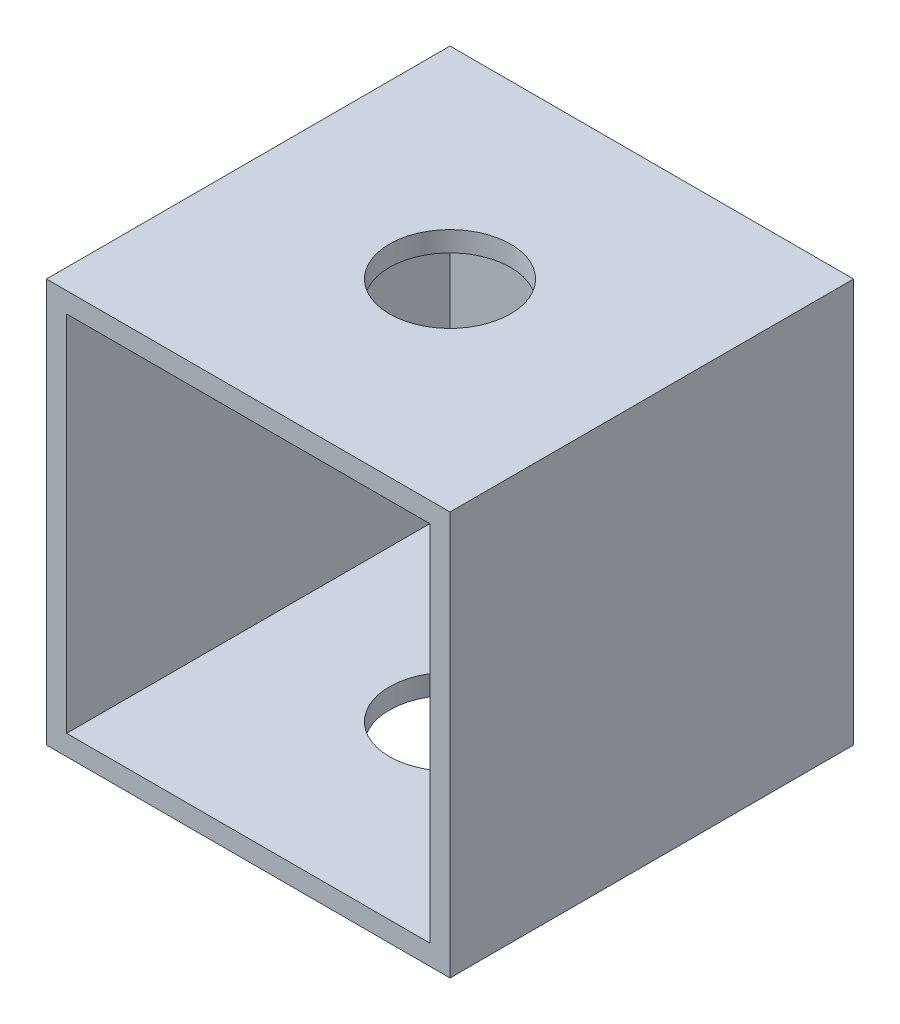
ISO-10303-21;
HEADER;
FILE_DESCRIPTION(('STEP AP214'),'2;1');
FILE_NAME('part.step','',(''),(''),'','','');
FILE_SCHEMA(('AUTOMOTIVE_DESIGN { 1 0 10303 214 1 1 1 1 }'));
ENDSEC;
DATA;
#1=APPLICATION_CONTEXT('core data for automotive mechanical design processes');
#2=APPLICATION_PROTOCOL_DEFINITION('international standard','automotive_design',2000,#1);
#3=PRODUCT_CONTEXT('',#1,'mechanical');
#4=PRODUCT('Part','Part','',(#3));
#5=PRODUCT_RELATED_PRODUCT_CATEGORY('part','',(#4));
#6=PRODUCT_DEFINITION_FORMATION('','',#4);
#7=PRODUCT_DEFINITION_CONTEXT('part definition',#1,'design');
#8=PRODUCT_DEFINITION('design','',#6,#7);
#9=PRODUCT_DEFINITION_SHAPE('','',#8);
#10=(LENGTH_UNIT() NAMED_UNIT(*) SI_UNIT(.MILLI.,.METRE.));
#11=(NAMED_UNIT(*) PLANE_ANGLE_UNIT() SI_UNIT($,.RADIAN.));
#12=(NAMED_UNIT(*) SI_UNIT($,.STERADIAN.) SOLID_ANGLE_UNIT());
#13=UNCERTAINTY_MEASURE_WITH_UNIT(LENGTH_MEASURE(1.E-05),#10,'distance_accuracy_value','');
#14=(GEOMETRIC_REPRESENTATION_CONTEXT(3) GLOBAL_UNCERTAINTY_ASSIGNED_CONTEXT((#13)) GLOBAL_UNIT_ASSIGNED_CONTEXT((#10,
#11,#12)) REPRESENTATION_CONTEXT('',''));
#15=CARTESIAN_POINT('',(0.,0.,0.));
#16=DIRECTION('',(0.,0.,1.));
#17=DIRECTION('',(1.,0.,0.));
#18=AXIS2_PLACEMENT_3D('',#15,#16,#17);
#19=CARTESIAN_POINT('',(0.,0.,40.));
#20=DIRECTION('',(0.,0.,-1.));
#21=DIRECTION('',(-1.,0.,0.));
#22=AXIS2_PLACEMENT_3D('',#19,#20,#21);
#23=PLANE('',#22);
#24=DIRECTION('',(1.,0.,0.));
#25=VECTOR('',#24,1.);
#26=CARTESIAN_POINT('',(20.,-20.,40.));
#27=LINE('',#26,#25);
#28=CARTESIAN_POINT('',(-20.,-20.,40.));
#29=VERTEX_POINT('',#28);
#30=CARTESIAN_POINT('',(20.,-20.,40.));
#31=VERTEX_POINT('',#30);
#32=EDGE_CURVE('E148',#29,#31,#27,.T.);
#33=ORIENTED_EDGE('',*,*,#32,.T.);
#34=DIRECTION('',(0.,1.,0.));
#35=VECTOR('',#34,1.);
#36=CARTESIAN_POINT('',(20.,-20.,40.));
#37=LINE('',#36,#35);
#38=CARTESIAN_POINT('',(20.,20.,40.));
#39=VERTEX_POINT('',#38);
#40=EDGE_CURVE('E92',#31,#39,#37,.T.);
#41=ORIENTED_EDGE('',*,*,#40,.T.);
#42=DIRECTION('',(-1.,0.,0.));
#43=VECTOR('',#42,1.);
#44=CARTESIAN_POINT('',(20.,20.,40.));
#45=LINE('',#44,#43);
#46=CARTESIAN_POINT('',(-20.,20.,40.));
#47=VERTEX_POINT('',#46);
#48=EDGE_CURVE('E151',#39,#47,#45,.T.);
#49=ORIENTED_EDGE('',*,*,#48,.T.);
#50=DIRECTION('',(0.,-1.,0.));
#51=VECTOR('',#50,1.);
#52=CARTESIAN_POINT('',(-20.,-20.,40.));
#53=LINE('',#52,#51);
#54=EDGE_CURVE('E64',#47,#29,#53,.T.);
#55=ORIENTED_EDGE('',*,*,#54,.T.);
#56=EDGE_LOOP('',(#33,#41,#49,#55));
#57=FACE_BOUND('',#56,.T.);
#58=DIRECTION('',(1.,0.,0.));
#59=VECTOR('',#58,1.);
#60=CARTESIAN_POINT('',(0.,-18.,40.));
#61=LINE('',#60,#59);
#62=CARTESIAN_POINT('',(-18.,-18.,40.));
#63=VERTEX_POINT('',#62);
#64=CARTESIAN_POINT('',(18.,-18.,40.));
#65=VERTEX_POINT('',#64);
#66=EDGE_CURVE('E137',#63,#65,#61,.T.);
#67=ORIENTED_EDGE('',*,*,#66,.F.);
#68=DIRECTION('',(0.,-1.,0.));
#69=VECTOR('',#68,1.);
#70=CARTESIAN_POINT('',(-18.,0.,40.));
#71=LINE('',#70,#69);
#72=CARTESIAN_POINT('',(-18.,18.,40.));
#73=VERTEX_POINT('',#72);
#74=EDGE_CURVE('E146',#73,#63,#71,.T.);
#75=ORIENTED_EDGE('',*,*,#74,.F.);
#76=DIRECTION('',(-1.,0.,0.));
#77=VECTOR('',#76,1.);
#78=CARTESIAN_POINT('',(0.,18.,40.));
#79=LINE('',#78,#77);
#80=CARTESIAN_POINT('',(18.,18.,40.));
#81=VERTEX_POINT('',#80);
#82=EDGE_CURVE('E144',#81,#73,#79,.T.);
#83=ORIENTED_EDGE('',*,*,#82,.F.);
#84=DIRECTION('',(0.,1.,0.));
#85=VECTOR('',#84,1.);
#86=CARTESIAN_POINT('',(18.,0.,40.));
#87=LINE('',#86,#85);
#88=EDGE_CURVE('E129',#65,#81,#87,.T.);
#89=ORIENTED_EDGE('',*,*,#88,.F.);
#90=EDGE_LOOP('',(#67,#75,#83,#89));
#91=FACE_BOUND('',#90,.T.);
#92=ADVANCED_FACE('F39',(#57,#91),#23,.F.);
#93=CARTESIAN_POINT('',(20.,-20.,40.));
#94=DIRECTION('',(0.,1.,0.));
#95=DIRECTION('',(0.,0.,1.));
#96=AXIS2_PLACEMENT_3D('',#93,#94,#95);
#97=PLANE('',#96);
#98=CARTESIAN_POINT('',(0.,-20.,20.));
#99=DIRECTION('',(0.,1.,0.));
#100=DIRECTION('',(0.,0.,1.));
#101=AXIS2_PLACEMENT_3D('',#98,#99,#100);
#102=CIRCLE('',#101,6.);
#103=CARTESIAN_POINT('',(0.,-20.,26.));
#104=VERTEX_POINT('',#103);
#105=EDGE_CURVE('E226',#104,#104,#102,.T.);
#106=ORIENTED_EDGE('',*,*,#105,.T.);
#107=EDGE_LOOP('',(#106));
#108=FACE_BOUND('',#107,.T.);
#109=DIRECTION('',(1.,0.,0.));
#110=VECTOR('',#109,1.);
#111=CARTESIAN_POINT('',(20.,-20.,0.));
#112=LINE('',#111,#110);
#113=CARTESIAN_POINT('',(-20.,-20.,0.));
#114=VERTEX_POINT('',#113);
#115=CARTESIAN_POINT('',(20.,-20.,0.));
#116=VERTEX_POINT('',#115);
#117=EDGE_CURVE('E155',#114,#116,#112,.T.);
#118=ORIENTED_EDGE('',*,*,#117,.T.);
#119=DIRECTION('',(0.,0.,-1.));
#120=VECTOR('',#119,1.);
#121=CARTESIAN_POINT('',(20.,-20.,40.));
#122=LINE('',#121,#120);
#123=EDGE_CURVE('E11',#31,#116,#122,.T.);
#124=ORIENTED_EDGE('',*,*,#123,.F.);
#125=ORIENTED_EDGE('',*,*,#32,.F.);
#126=DIRECTION('',(0.,0.,-1.));
#127=VECTOR('',#126,1.);
#128=CARTESIAN_POINT('',(-20.,-20.,40.));
#129=LINE('',#128,#127);
#130=EDGE_CURVE('E154',#29,#114,#129,.T.);
#131=ORIENTED_EDGE('',*,*,#130,.T.);
#132=EDGE_LOOP('',(#118,#124,#125,#131));
#133=FACE_BOUND('',#132,.T.);
#134=ADVANCED_FACE('F41',(#108,#133),#97,.F.);
#135=CARTESIAN_POINT('',(20.,-20.,40.));
#136=DIRECTION('',(-1.,0.,0.));
#137=DIRECTION('',(0.,0.,1.));
#138=AXIS2_PLACEMENT_3D('',#135,#136,#137);
#139=PLANE('',#138);
#140=DIRECTION('',(0.,1.,0.));
#141=VECTOR('',#140,1.);
#142=CARTESIAN_POINT('',(20.,-20.,0.));
#143=LINE('',#142,#141);
#144=CARTESIAN_POINT('',(20.,20.,0.));
#145=VERTEX_POINT('',#144);
#146=EDGE_CURVE('E158',#116,#145,#143,.T.);
#147=ORIENTED_EDGE('',*,*,#146,.T.);
#148=DIRECTION('',(0.,0.,-1.));
#149=VECTOR('',#148,1.);
#150=CARTESIAN_POINT('',(20.,20.,40.));
#151=LINE('',#150,#149);
#152=EDGE_CURVE('E48',#39,#145,#151,.T.);
#153=ORIENTED_EDGE('',*,*,#152,.F.);
#154=ORIENTED_EDGE('',*,*,#40,.F.);
#155=ORIENTED_EDGE('',*,*,#123,.T.);
#156=EDGE_LOOP('',(#147,#153,#154,#155));
#157=FACE_BOUND('',#156,.T.);
#158=ADVANCED_FACE('F188',(#157),#139,.F.);
#159=CARTESIAN_POINT('',(20.,20.,40.));
#160=DIRECTION('',(0.,-1.,0.));
#161=DIRECTION('',(0.,0.,-1.));
#162=AXIS2_PLACEMENT_3D('',#159,#160,#161);
#163=PLANE('',#162);
#164=CARTESIAN_POINT('',(0.,20.,20.));
#165=DIRECTION('',(0.,1.,0.));
#166=DIRECTION('',(0.,0.,1.));
#167=AXIS2_PLACEMENT_3D('',#164,#165,#166);
#168=CIRCLE('',#167,6.);
#169=CARTESIAN_POINT('',(0.,20.,26.));
#170=VERTEX_POINT('',#169);
#171=EDGE_CURVE('E225',#170,#170,#168,.T.);
#172=ORIENTED_EDGE('',*,*,#171,.F.);
#173=EDGE_LOOP('',(#172));
#174=FACE_BOUND('',#173,.T.);
#175=DIRECTION('',(-1.,0.,0.));
#176=VECTOR('',#175,1.);
#177=CARTESIAN_POINT('',(20.,20.,0.));
#178=LINE('',#177,#176);
#179=CARTESIAN_POINT('',(-20.,20.,0.));
#180=VERTEX_POINT('',#179);
#181=EDGE_CURVE('E160',#145,#180,#178,.T.);
#182=ORIENTED_EDGE('',*,*,#181,.T.);
#183=DIRECTION('',(0.,0.,-1.));
#184=VECTOR('',#183,1.);
#185=CARTESIAN_POINT('',(-20.,20.,40.));
#186=LINE('',#185,#184);
#187=EDGE_CURVE('E164',#47,#180,#186,.T.);
#188=ORIENTED_EDGE('',*,*,#187,.F.);
#189=ORIENTED_EDGE('',*,*,#48,.F.);
#190=ORIENTED_EDGE('',*,*,#152,.T.);
#191=EDGE_LOOP('',(#182,#188,#189,#190));
#192=FACE_BOUND('',#191,.T.);
#193=ADVANCED_FACE('F170',(#174,#192),#163,.F.);
#194=CARTESIAN_POINT('',(-20.,-20.,40.));
#195=DIRECTION('',(1.,0.,0.));
#196=DIRECTION('',(0.,0.,-1.));
#197=AXIS2_PLACEMENT_3D('',#194,#195,#196);
#198=PLANE('',#197);
#199=DIRECTION('',(0.,-1.,0.));
#200=VECTOR('',#199,1.);
#201=CARTESIAN_POINT('',(-20.,-20.,0.));
#202=LINE('',#201,#200);
#203=EDGE_CURVE('E85',#180,#114,#202,.T.);
#204=ORIENTED_EDGE('',*,*,#203,.T.);
#205=ORIENTED_EDGE('',*,*,#130,.F.);
#206=ORIENTED_EDGE('',*,*,#54,.F.);
#207=ORIENTED_EDGE('',*,*,#187,.T.);
#208=EDGE_LOOP('',(#204,#205,#206,#207));
#209=FACE_BOUND('',#208,.T.);
#210=ADVANCED_FACE('F178',(#209),#198,.F.);
#211=CARTESIAN_POINT('',(0.,0.,0.));
#212=DIRECTION('',(0.,0.,-1.));
#213=DIRECTION('',(-1.,0.,0.));
#214=AXIS2_PLACEMENT_3D('',#211,#212,#213);
#215=PLANE('',#214);
#216=ORIENTED_EDGE('',*,*,#117,.F.);
#217=ORIENTED_EDGE('',*,*,#203,.F.);
#218=ORIENTED_EDGE('',*,*,#181,.F.);
#219=ORIENTED_EDGE('',*,*,#146,.F.);
#220=EDGE_LOOP('',(#216,#217,#218,#219));
#221=FACE_BOUND('',#220,.T.);
#222=ADVANCED_FACE('F174',(#221),#215,.T.);
#223=CARTESIAN_POINT('',(20.,-18.,40.));
#224=DIRECTION('',(0.,1.,0.));
#225=DIRECTION('',(0.,0.,1.));
#226=AXIS2_PLACEMENT_3D('',#223,#224,#225);
#227=PLANE('',#226);
#228=CARTESIAN_POINT('',(0.,-18.,20.));
#229=DIRECTION('',(0.,1.,0.));
#230=DIRECTION('',(0.,0.,1.));
#231=AXIS2_PLACEMENT_3D('',#228,#229,#230);
#232=CIRCLE('',#231,6.);
#233=CARTESIAN_POINT('',(0.,-18.,26.));
#234=VERTEX_POINT('',#233);
#235=EDGE_CURVE('E231',#234,#234,#232,.T.);
#236=ORIENTED_EDGE('',*,*,#235,.F.);
#237=EDGE_LOOP('',(#236));
#238=FACE_BOUND('',#237,.T.);
#239=DIRECTION('',(1.,0.,0.));
#240=VECTOR('',#239,1.);
#241=CARTESIAN_POINT('',(0.,-18.,2.));
#242=LINE('',#241,#240);
#243=CARTESIAN_POINT('',(-18.,-18.,2.));
#244=VERTEX_POINT('',#243);
#245=CARTESIAN_POINT('',(18.,-18.,2.));
#246=VERTEX_POINT('',#245);
#247=EDGE_CURVE('E120',#244,#246,#242,.T.);
#248=ORIENTED_EDGE('',*,*,#247,.F.);
#249=DIRECTION('',(0.,0.,-1.));
#250=VECTOR('',#249,1.);
#251=CARTESIAN_POINT('',(-18.,-18.,40.));
#252=LINE('',#251,#250);
#253=EDGE_CURVE('E140',#63,#244,#252,.T.);
#254=ORIENTED_EDGE('',*,*,#253,.F.);
#255=ORIENTED_EDGE('',*,*,#66,.T.);
#256=DIRECTION('',(0.,0.,-1.));
#257=VECTOR('',#256,1.);
#258=CARTESIAN_POINT('',(18.,-18.,40.));
#259=LINE('',#258,#257);
#260=EDGE_CURVE('E132',#65,#246,#259,.T.);
#261=ORIENTED_EDGE('',*,*,#260,.T.);
#262=EDGE_LOOP('',(#248,#254,#255,#261));
#263=FACE_BOUND('',#262,.T.);
#264=ADVANCED_FACE('F185',(#238,#263),#227,.T.);
#265=CARTESIAN_POINT('',(18.,-20.,40.));
#266=DIRECTION('',(-1.,0.,0.));
#267=DIRECTION('',(0.,0.,1.));
#268=AXIS2_PLACEMENT_3D('',#265,#266,#267);
#269=PLANE('',#268);
#270=DIRECTION('',(0.,1.,0.));
#271=VECTOR('',#270,1.);
#272=CARTESIAN_POINT('',(18.,0.,2.));
#273=LINE('',#272,#271);
#274=CARTESIAN_POINT('',(18.,18.,2.));
#275=VERTEX_POINT('',#274);
#276=EDGE_CURVE('E114',#246,#275,#273,.T.);
#277=ORIENTED_EDGE('',*,*,#276,.F.);
#278=ORIENTED_EDGE('',*,*,#260,.F.);
#279=ORIENTED_EDGE('',*,*,#88,.T.);
#280=DIRECTION('',(0.,0.,-1.));
#281=VECTOR('',#280,1.);
#282=CARTESIAN_POINT('',(18.,18.,40.));
#283=LINE('',#282,#281);
#284=EDGE_CURVE('E126',#81,#275,#283,.T.);
#285=ORIENTED_EDGE('',*,*,#284,.T.);
#286=EDGE_LOOP('',(#277,#278,#279,#285));
#287=FACE_BOUND('',#286,.T.);
#288=ADVANCED_FACE('F127',(#287),#269,.T.);
#289=CARTESIAN_POINT('',(20.,18.,40.));
#290=DIRECTION('',(0.,-1.,0.));
#291=DIRECTION('',(0.,0.,-1.));
#292=AXIS2_PLACEMENT_3D('',#289,#290,#291);
#293=PLANE('',#292);
#294=CARTESIAN_POINT('',(0.,18.,20.));
#295=DIRECTION('',(0.,-1.,0.));
#296=DIRECTION('',(0.,0.,-1.));
#297=AXIS2_PLACEMENT_3D('',#294,#295,#296);
#298=CIRCLE('',#297,6.);
#299=CARTESIAN_POINT('',(0.,18.,14.));
#300=VERTEX_POINT('',#299);
#301=EDGE_CURVE('E43',#300,#300,#298,.T.);
#302=ORIENTED_EDGE('',*,*,#301,.F.);
#303=EDGE_LOOP('',(#302));
#304=FACE_BOUND('',#303,.T.);
#305=DIRECTION('',(-1.,0.,0.));
#306=VECTOR('',#305,1.);
#307=CARTESIAN_POINT('',(0.,18.,2.));
#308=LINE('',#307,#306);
#309=CARTESIAN_POINT('',(-18.,18.,2.));
#310=VERTEX_POINT('',#309);
#311=EDGE_CURVE('E118',#275,#310,#308,.T.);
#312=ORIENTED_EDGE('',*,*,#311,.F.);
#313=ORIENTED_EDGE('',*,*,#284,.F.);
#314=ORIENTED_EDGE('',*,*,#82,.T.);
#315=DIRECTION('',(0.,0.,-1.));
#316=VECTOR('',#315,1.);
#317=CARTESIAN_POINT('',(-18.,18.,40.));
#318=LINE('',#317,#316);
#319=EDGE_CURVE('E55',#73,#310,#318,.T.);
#320=ORIENTED_EDGE('',*,*,#319,.T.);
#321=EDGE_LOOP('',(#312,#313,#314,#320));
#322=FACE_BOUND('',#321,.T.);
#323=ADVANCED_FACE('F134',(#304,#322),#293,.T.);
#324=CARTESIAN_POINT('',(-18.,-20.,40.));
#325=DIRECTION('',(1.,0.,0.));
#326=DIRECTION('',(0.,0.,-1.));
#327=AXIS2_PLACEMENT_3D('',#324,#325,#326);
#328=PLANE('',#327);
#329=DIRECTION('',(0.,-1.,0.));
#330=VECTOR('',#329,1.);
#331=CARTESIAN_POINT('',(-18.,0.,2.));
#332=LINE('',#331,#330);
#333=EDGE_CURVE('E135',#310,#244,#332,.T.);
#334=ORIENTED_EDGE('',*,*,#333,.F.);
#335=ORIENTED_EDGE('',*,*,#319,.F.);
#336=ORIENTED_EDGE('',*,*,#74,.T.);
#337=ORIENTED_EDGE('',*,*,#253,.T.);
#338=EDGE_LOOP('',(#334,#335,#336,#337));
#339=FACE_BOUND('',#338,.T.);
#340=ADVANCED_FACE('F203',(#339),#328,.T.);
#341=CARTESIAN_POINT('',(0.,0.,2.));
#342=DIRECTION('',(0.,0.,-1.));
#343=DIRECTION('',(-1.,0.,0.));
#344=AXIS2_PLACEMENT_3D('',#341,#342,#343);
#345=PLANE('',#344);
#346=ORIENTED_EDGE('',*,*,#247,.T.);
#347=ORIENTED_EDGE('',*,*,#276,.T.);
#348=ORIENTED_EDGE('',*,*,#311,.T.);
#349=ORIENTED_EDGE('',*,*,#333,.T.);
#350=EDGE_LOOP('',(#346,#347,#348,#349));
#351=FACE_BOUND('',#350,.T.);
#352=ADVANCED_FACE('F116',(#351),#345,.F.);
#353=CARTESIAN_POINT('',(0.,-20.,20.));
#354=DIRECTION('',(0.,1.,0.));
#355=DIRECTION('',(0.,0.,1.));
#356=AXIS2_PLACEMENT_3D('',#353,#354,#355);
#357=CYLINDRICAL_SURFACE('',#356,6.);
#358=ORIENTED_EDGE('',*,*,#301,.T.);
#359=EDGE_LOOP('',(#358));
#360=FACE_BOUND('',#359,.T.);
#361=ORIENTED_EDGE('',*,*,#171,.T.);
#362=EDGE_LOOP('',(#361));
#363=FACE_BOUND('',#362,.T.);
#364=ADVANCED_FACE('F202',(#360,#363),#357,.F.);
#365=ORIENTED_EDGE('',*,*,#235,.T.);
#366=EDGE_LOOP('',(#365));
#367=FACE_BOUND('',#366,.T.);
#368=ORIENTED_EDGE('',*,*,#105,.F.);
#369=EDGE_LOOP('',(#368));
#370=FACE_BOUND('',#369,.T.);
#371=ADVANCED_FACE('F214',(#367,#370),#357,.F.);
#372=CLOSED_SHELL('',(#92,#134,#158,#193,#210,#222,#264,#288,#323,#340,#352,#364,#371));
#373=MANIFOLD_SOLID_BREP('B2',#372);
#374=ADVANCED_BREP_SHAPE_REPRESENTATION('',(#18,#373),#14);
#375=SHAPE_DEFINITION_REPRESENTATION(#9,#374);
ENDSEC;
END-ISO-10303-21;
